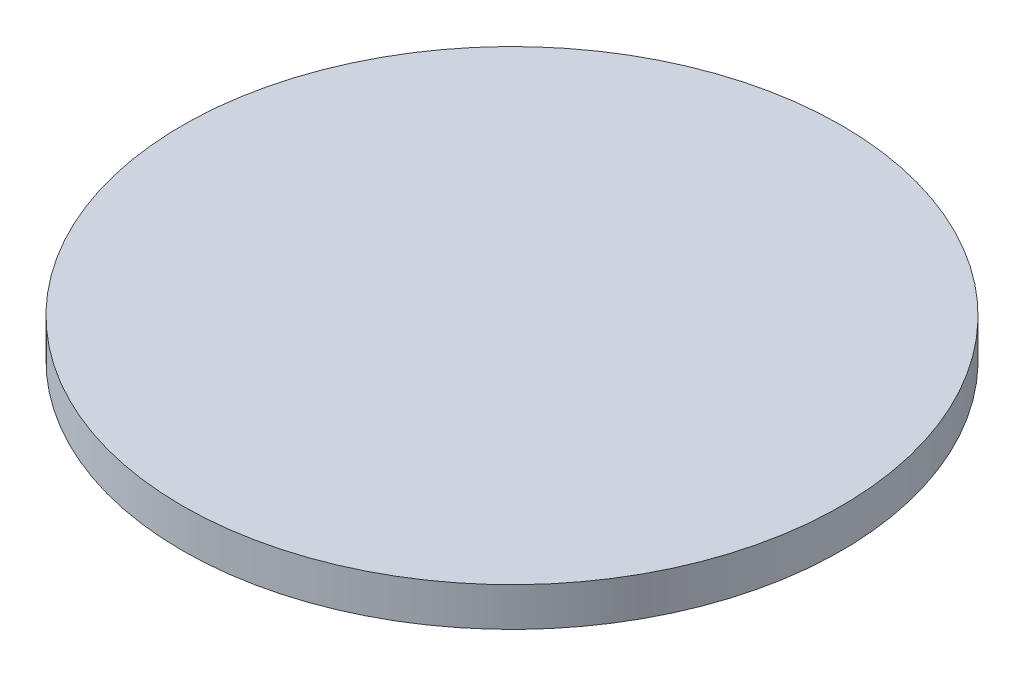
ISO-10303-21;
HEADER;
FILE_DESCRIPTION(('STEP AP214'),'2;1');
FILE_NAME('part.step','',(''),(''),'','','');
FILE_SCHEMA(('AUTOMOTIVE_DESIGN { 1 0 10303 214 1 1 1 1 }'));
ENDSEC;
DATA;
#1=APPLICATION_CONTEXT('core data for automotive mechanical design processes');
#2=APPLICATION_PROTOCOL_DEFINITION('international standard','automotive_design',2000,#1);
#3=PRODUCT_CONTEXT('',#1,'mechanical');
#4=PRODUCT('Part','Part','',(#3));
#5=PRODUCT_RELATED_PRODUCT_CATEGORY('part','',(#4));
#6=PRODUCT_DEFINITION_FORMATION('','',#4);
#7=PRODUCT_DEFINITION_CONTEXT('part definition',#1,'design');
#8=PRODUCT_DEFINITION('design','',#6,#7);
#9=PRODUCT_DEFINITION_SHAPE('','',#8);
#10=(LENGTH_UNIT() NAMED_UNIT(*) SI_UNIT(.MILLI.,.METRE.));
#11=(NAMED_UNIT(*) PLANE_ANGLE_UNIT() SI_UNIT($,.RADIAN.));
#12=(NAMED_UNIT(*) SI_UNIT($,.STERADIAN.) SOLID_ANGLE_UNIT());
#13=UNCERTAINTY_MEASURE_WITH_UNIT(LENGTH_MEASURE(1.E-05),#10,'distance_accuracy_value','');
#14=(GEOMETRIC_REPRESENTATION_CONTEXT(3) GLOBAL_UNCERTAINTY_ASSIGNED_CONTEXT((#13)) GLOBAL_UNIT_ASSIGNED_CONTEXT((#10,
#11,#12)) REPRESENTATION_CONTEXT('',''));
#15=CARTESIAN_POINT('',(0.,0.,0.));
#16=DIRECTION('',(0.,0.,1.));
#17=DIRECTION('',(1.,0.,0.));
#18=AXIS2_PLACEMENT_3D('',#15,#16,#17);
#19=CARTESIAN_POINT('',(0.,0.25,0.));
#20=DIRECTION('',(0.,-1.,0.));
#21=DIRECTION('',(0.,0.,-1.));
#22=AXIS2_PLACEMENT_3D('',#19,#20,#21);
#23=CYLINDRICAL_SURFACE('',#22,2.125);
#24=CARTESIAN_POINT('',(0.,0.25,0.));
#25=DIRECTION('',(0.,1.,0.));
#26=DIRECTION('',(0.,0.,1.));
#27=AXIS2_PLACEMENT_3D('',#24,#25,#26);
#28=CIRCLE('',#27,2.125);
#29=CARTESIAN_POINT('',(0.,0.25,2.125));
#30=VERTEX_POINT('',#29);
#31=EDGE_CURVE('E10',#30,#30,#28,.T.);
#32=ORIENTED_EDGE('',*,*,#31,.F.);
#33=EDGE_LOOP('',(#32));
#34=FACE_BOUND('',#33,.T.);
#35=CARTESIAN_POINT('',(0.,0.,0.));
#36=DIRECTION('',(0.,1.,0.));
#37=DIRECTION('',(0.,0.,1.));
#38=AXIS2_PLACEMENT_3D('',#35,#36,#37);
#39=CIRCLE('',#38,2.125);
#40=CARTESIAN_POINT('',(0.,0.,2.125));
#41=VERTEX_POINT('',#40);
#42=EDGE_CURVE('E44',#41,#41,#39,.T.);
#43=ORIENTED_EDGE('',*,*,#42,.T.);
#44=EDGE_LOOP('',(#43));
#45=FACE_BOUND('',#44,.T.);
#46=ADVANCED_FACE('F41',(#34,#45),#23,.T.);
#47=CARTESIAN_POINT('',(0.,0.25,0.));
#48=DIRECTION('',(0.,1.,0.));
#49=DIRECTION('',(0.,0.,1.));
#50=AXIS2_PLACEMENT_3D('',#47,#48,#49);
#51=PLANE('',#50);
#52=ORIENTED_EDGE('',*,*,#31,.T.);
#53=EDGE_LOOP('',(#52));
#54=FACE_BOUND('',#53,.T.);
#55=ADVANCED_FACE('F58',(#54),#51,.T.);
#56=CARTESIAN_POINT('',(0.,0.,0.));
#57=DIRECTION('',(0.,1.,0.));
#58=DIRECTION('',(0.,0.,1.));
#59=AXIS2_PLACEMENT_3D('',#56,#57,#58);
#60=PLANE('',#59);
#61=ORIENTED_EDGE('',*,*,#42,.F.);
#62=EDGE_LOOP('',(#61));
#63=FACE_BOUND('',#62,.T.);
#64=ADVANCED_FACE('F56',(#63),#60,.F.);
#65=CLOSED_SHELL('',(#46,#55,#64));
#66=MANIFOLD_SOLID_BREP('B2',#65);
#67=ADVANCED_BREP_SHAPE_REPRESENTATION('',(#18,#66),#14);
#68=SHAPE_DEFINITION_REPRESENTATION(#9,#67);
ENDSEC;
END-ISO-10303-21;
